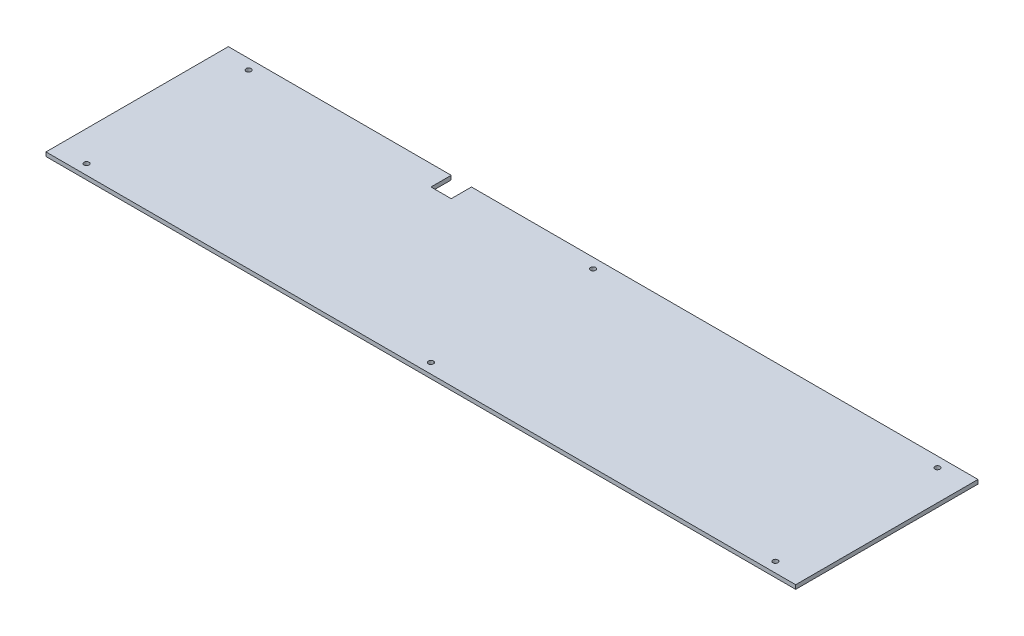
ISO-10303-21;
HEADER;
FILE_DESCRIPTION(('STEP AP214'),'2;1');
FILE_NAME('part.step','',(''),(''),'','','');
FILE_SCHEMA(('AUTOMOTIVE_DESIGN { 1 0 10303 214 1 1 1 1 }'));
ENDSEC;
DATA;
#1=APPLICATION_CONTEXT('core data for automotive mechanical design processes');
#2=APPLICATION_PROTOCOL_DEFINITION('international standard','automotive_design',2000,#1);
#3=PRODUCT_CONTEXT('',#1,'mechanical');
#4=PRODUCT('Part','Part','',(#3));
#5=PRODUCT_RELATED_PRODUCT_CATEGORY('part','',(#4));
#6=PRODUCT_DEFINITION_FORMATION('','',#4);
#7=PRODUCT_DEFINITION_CONTEXT('part definition',#1,'design');
#8=PRODUCT_DEFINITION('design','',#6,#7);
#9=PRODUCT_DEFINITION_SHAPE('','',#8);
#10=(LENGTH_UNIT() NAMED_UNIT(*) SI_UNIT(.MILLI.,.METRE.));
#11=(NAMED_UNIT(*) PLANE_ANGLE_UNIT() SI_UNIT($,.RADIAN.));
#12=(NAMED_UNIT(*) SI_UNIT($,.STERADIAN.) SOLID_ANGLE_UNIT());
#13=UNCERTAINTY_MEASURE_WITH_UNIT(LENGTH_MEASURE(1.E-05),#10,'distance_accuracy_value','');
#14=(GEOMETRIC_REPRESENTATION_CONTEXT(3) GLOBAL_UNCERTAINTY_ASSIGNED_CONTEXT((#13)) GLOBAL_UNIT_ASSIGNED_CONTEXT((#10,
#11,#12)) REPRESENTATION_CONTEXT('',''));
#15=CARTESIAN_POINT('',(0.,0.,0.));
#16=DIRECTION('',(0.,0.,1.));
#17=DIRECTION('',(1.,0.,0.));
#18=AXIS2_PLACEMENT_3D('',#15,#16,#17);
#19=CARTESIAN_POINT('',(0.,4.,0.));
#20=DIRECTION('',(0.,1.,0.));
#21=DIRECTION('',(0.,0.,1.));
#22=AXIS2_PLACEMENT_3D('',#19,#20,#21);
#23=PLANE('',#22);
#24=CARTESIAN_POINT('',(0.,4.,80.0000000000001));
#25=DIRECTION('',(0.,1.,0.));
#26=DIRECTION('',(0.,0.,-1.));
#27=AXIS2_PLACEMENT_3D('',#24,#25,#26);
#28=CIRCLE('',#27,2.5);
#29=CARTESIAN_POINT('',(0.,4.,77.5000000000001));
#30=VERTEX_POINT('',#29);
#31=EDGE_CURVE('E237',#30,#30,#28,.T.);
#32=ORIENTED_EDGE('',*,*,#31,.F.);
#33=EDGE_LOOP('',(#32));
#34=FACE_BOUND('',#33,.T.);
#35=CARTESIAN_POINT('',(0.,4.,-80.));
#36=DIRECTION('',(0.,1.,0.));
#37=DIRECTION('',(0.,0.,1.));
#38=AXIS2_PLACEMENT_3D('',#35,#36,#37);
#39=CIRCLE('',#38,2.5);
#40=CARTESIAN_POINT('',(0.,4.,-77.5));
#41=VERTEX_POINT('',#40);
#42=EDGE_CURVE('E221',#41,#41,#39,.T.);
#43=ORIENTED_EDGE('',*,*,#42,.F.);
#44=EDGE_LOOP('',(#43));
#45=FACE_BOUND('',#44,.T.);
#46=CARTESIAN_POINT('',(-340.,4.,-80.0000000000001));
#47=DIRECTION('',(0.,1.,0.));
#48=DIRECTION('',(0.,0.,1.));
#49=AXIS2_PLACEMENT_3D('',#46,#47,#48);
#50=CIRCLE('',#49,2.50000000000002);
#51=CARTESIAN_POINT('',(-340.,4.,-77.5000000000001));
#52=VERTEX_POINT('',#51);
#53=EDGE_CURVE('E146',#52,#52,#50,.T.);
#54=ORIENTED_EDGE('',*,*,#53,.F.);
#55=EDGE_LOOP('',(#54));
#56=FACE_BOUND('',#55,.T.);
#57=DIRECTION('',(-1.,0.,0.));
#58=VECTOR('',#57,1.);
#59=CARTESIAN_POINT('',(-130.,4.,-90.));
#60=LINE('',#59,#58);
#61=CARTESIAN_POINT('',(370.,4.,-90.0000000000002));
#62=VERTEX_POINT('',#61);
#63=CARTESIAN_POINT('',(-130.,4.,-90.));
#64=VERTEX_POINT('',#63);
#65=EDGE_CURVE('E164',#62,#64,#60,.T.);
#66=ORIENTED_EDGE('',*,*,#65,.T.);
#67=DIRECTION('',(0.,0.,1.));
#68=VECTOR('',#67,1.);
#69=CARTESIAN_POINT('',(-130.,4.,-90.));
#70=LINE('',#69,#68);
#71=CARTESIAN_POINT('',(-130.,4.,-70.));
#72=VERTEX_POINT('',#71);
#73=EDGE_CURVE('E100',#64,#72,#70,.T.);
#74=ORIENTED_EDGE('',*,*,#73,.T.);
#75=DIRECTION('',(-1.,0.,0.));
#76=VECTOR('',#75,1.);
#77=CARTESIAN_POINT('',(-130.,4.,-70.));
#78=LINE('',#77,#76);
#79=CARTESIAN_POINT('',(-150.,4.,-70.));
#80=VERTEX_POINT('',#79);
#81=EDGE_CURVE('E185',#72,#80,#78,.T.);
#82=ORIENTED_EDGE('',*,*,#81,.T.);
#83=DIRECTION('',(0.,0.,-1.));
#84=VECTOR('',#83,1.);
#85=CARTESIAN_POINT('',(-150.,4.,-90.));
#86=LINE('',#85,#84);
#87=CARTESIAN_POINT('',(-150.,4.,-90.));
#88=VERTEX_POINT('',#87);
#89=EDGE_CURVE('E199',#80,#88,#86,.T.);
#90=ORIENTED_EDGE('',*,*,#89,.T.);
#91=DIRECTION('',(-1.,0.,0.));
#92=VECTOR('',#91,1.);
#93=CARTESIAN_POINT('',(-370.,4.,-90.0000000000001));
#94=LINE('',#93,#92);
#95=CARTESIAN_POINT('',(-370.,4.,-90.0000000000001));
#96=VERTEX_POINT('',#95);
#97=EDGE_CURVE('E119',#88,#96,#94,.T.);
#98=ORIENTED_EDGE('',*,*,#97,.T.);
#99=DIRECTION('',(0.,0.,1.));
#100=VECTOR('',#99,1.);
#101=CARTESIAN_POINT('',(-370.,4.,89.9999999999999));
#102=LINE('',#101,#100);
#103=CARTESIAN_POINT('',(-370.,4.,89.9999999999999));
#104=VERTEX_POINT('',#103);
#105=EDGE_CURVE('E113',#96,#104,#102,.T.);
#106=ORIENTED_EDGE('',*,*,#105,.T.);
#107=DIRECTION('',(1.,0.,0.));
#108=VECTOR('',#107,1.);
#109=CARTESIAN_POINT('',(-370.,4.,89.9999999999999));
#110=LINE('',#109,#108);
#111=CARTESIAN_POINT('',(370.,4.,89.9999999999998));
#112=VERTEX_POINT('',#111);
#113=EDGE_CURVE('E117',#104,#112,#110,.T.);
#114=ORIENTED_EDGE('',*,*,#113,.T.);
#115=DIRECTION('',(0.,0.,-1.));
#116=VECTOR('',#115,1.);
#117=CARTESIAN_POINT('',(370.,4.,89.9999999999998));
#118=LINE('',#117,#116);
#119=EDGE_CURVE('E57',#112,#62,#118,.T.);
#120=ORIENTED_EDGE('',*,*,#119,.T.);
#121=EDGE_LOOP('',(#66,#74,#82,#90,#98,#106,#114,#120));
#122=FACE_BOUND('',#121,.T.);
#123=CARTESIAN_POINT('',(340.,4.,-80.0000000000002));
#124=DIRECTION('',(0.,1.,0.));
#125=DIRECTION('',(0.,0.,-1.));
#126=AXIS2_PLACEMENT_3D('',#123,#124,#125);
#127=CIRCLE('',#126,2.50000000000002);
#128=CARTESIAN_POINT('',(340.,4.,-82.5000000000002));
#129=VERTEX_POINT('',#128);
#130=EDGE_CURVE('E213',#129,#129,#127,.T.);
#131=ORIENTED_EDGE('',*,*,#130,.F.);
#132=EDGE_LOOP('',(#131));
#133=FACE_BOUND('',#132,.T.);
#134=CARTESIAN_POINT('',(-340.,4.,80.0000000000001));
#135=DIRECTION('',(0.,1.,0.));
#136=DIRECTION('',(0.,0.,-1.));
#137=AXIS2_PLACEMENT_3D('',#134,#135,#136);
#138=CIRCLE('',#137,2.50000000000002);
#139=CARTESIAN_POINT('',(-340.,4.,77.5000000000001));
#140=VERTEX_POINT('',#139);
#141=EDGE_CURVE('E229',#140,#140,#138,.T.);
#142=ORIENTED_EDGE('',*,*,#141,.F.);
#143=EDGE_LOOP('',(#142));
#144=FACE_BOUND('',#143,.T.);
#145=CARTESIAN_POINT('',(340.,4.,80.0000000000002));
#146=DIRECTION('',(0.,1.,0.));
#147=DIRECTION('',(0.,0.,1.));
#148=AXIS2_PLACEMENT_3D('',#145,#146,#147);
#149=CIRCLE('',#148,2.50000000000002);
#150=CARTESIAN_POINT('',(340.,4.,82.5000000000002));
#151=VERTEX_POINT('',#150);
#152=EDGE_CURVE('E245',#151,#151,#149,.T.);
#153=ORIENTED_EDGE('',*,*,#152,.F.);
#154=EDGE_LOOP('',(#153));
#155=FACE_BOUND('',#154,.T.);
#156=ADVANCED_FACE('F39',(#34,#45,#56,#122,#133,#144,#155),#23,.T.);
#157=CARTESIAN_POINT('',(0.,0.,0.));
#158=DIRECTION('',(0.,1.,0.));
#159=DIRECTION('',(0.,0.,1.));
#160=AXIS2_PLACEMENT_3D('',#157,#158,#159);
#161=PLANE('',#160);
#162=DIRECTION('',(-1.,0.,0.));
#163=VECTOR('',#162,1.);
#164=CARTESIAN_POINT('',(-130.,0.,-90.));
#165=LINE('',#164,#163);
#166=CARTESIAN_POINT('',(370.,0.,-90.0000000000002));
#167=VERTEX_POINT('',#166);
#168=CARTESIAN_POINT('',(-130.,0.,-90.));
#169=VERTEX_POINT('',#168);
#170=EDGE_CURVE('E141',#167,#169,#165,.T.);
#171=ORIENTED_EDGE('',*,*,#170,.F.);
#172=DIRECTION('',(0.,0.,-1.));
#173=VECTOR('',#172,1.);
#174=CARTESIAN_POINT('',(370.,0.,89.9999999999998));
#175=LINE('',#174,#173);
#176=CARTESIAN_POINT('',(370.,0.,89.9999999999998));
#177=VERTEX_POINT('',#176);
#178=EDGE_CURVE('E92',#177,#167,#175,.T.);
#179=ORIENTED_EDGE('',*,*,#178,.F.);
#180=DIRECTION('',(1.,0.,0.));
#181=VECTOR('',#180,1.);
#182=CARTESIAN_POINT('',(-370.,0.,89.9999999999999));
#183=LINE('',#182,#181);
#184=CARTESIAN_POINT('',(-370.,0.,89.9999999999999));
#185=VERTEX_POINT('',#184);
#186=EDGE_CURVE('E86',#185,#177,#183,.T.);
#187=ORIENTED_EDGE('',*,*,#186,.F.);
#188=DIRECTION('',(0.,0.,1.));
#189=VECTOR('',#188,1.);
#190=CARTESIAN_POINT('',(-370.,0.,89.9999999999999));
#191=LINE('',#190,#189);
#192=CARTESIAN_POINT('',(-370.,0.,-90.0000000000001));
#193=VERTEX_POINT('',#192);
#194=EDGE_CURVE('E128',#193,#185,#191,.T.);
#195=ORIENTED_EDGE('',*,*,#194,.F.);
#196=DIRECTION('',(-1.,0.,0.));
#197=VECTOR('',#196,1.);
#198=CARTESIAN_POINT('',(-370.,0.,-90.0000000000001));
#199=LINE('',#198,#197);
#200=CARTESIAN_POINT('',(-150.,0.,-90.));
#201=VERTEX_POINT('',#200);
#202=EDGE_CURVE('E155',#201,#193,#199,.T.);
#203=ORIENTED_EDGE('',*,*,#202,.F.);
#204=DIRECTION('',(0.,0.,-1.));
#205=VECTOR('',#204,1.);
#206=CARTESIAN_POINT('',(-150.,0.,-90.));
#207=LINE('',#206,#205);
#208=CARTESIAN_POINT('',(-150.,0.,-70.));
#209=VERTEX_POINT('',#208);
#210=EDGE_CURVE('E152',#209,#201,#207,.T.);
#211=ORIENTED_EDGE('',*,*,#210,.F.);
#212=DIRECTION('',(-1.,0.,0.));
#213=VECTOR('',#212,1.);
#214=CARTESIAN_POINT('',(-130.,0.,-70.));
#215=LINE('',#214,#213);
#216=CARTESIAN_POINT('',(-130.,0.,-70.));
#217=VERTEX_POINT('',#216);
#218=EDGE_CURVE('E149',#217,#209,#215,.T.);
#219=ORIENTED_EDGE('',*,*,#218,.F.);
#220=DIRECTION('',(0.,0.,1.));
#221=VECTOR('',#220,1.);
#222=CARTESIAN_POINT('',(-130.,0.,-90.));
#223=LINE('',#222,#221);
#224=EDGE_CURVE('E145',#169,#217,#223,.T.);
#225=ORIENTED_EDGE('',*,*,#224,.F.);
#226=EDGE_LOOP('',(#171,#179,#187,#195,#203,#211,#219,#225));
#227=FACE_BOUND('',#226,.T.);
#228=CARTESIAN_POINT('',(-340.,0.,-80.0000000000001));
#229=DIRECTION('',(0.,1.,0.));
#230=DIRECTION('',(0.,0.,1.));
#231=AXIS2_PLACEMENT_3D('',#228,#229,#230);
#232=CIRCLE('',#231,2.50000000000002);
#233=CARTESIAN_POINT('',(-340.,0.,-77.5000000000001));
#234=VERTEX_POINT('',#233);
#235=EDGE_CURVE('E209',#234,#234,#232,.T.);
#236=ORIENTED_EDGE('',*,*,#235,.T.);
#237=EDGE_LOOP('',(#236));
#238=FACE_BOUND('',#237,.T.);
#239=CARTESIAN_POINT('',(340.,0.,-80.0000000000002));
#240=DIRECTION('',(0.,1.,0.));
#241=DIRECTION('',(0.,0.,-1.));
#242=AXIS2_PLACEMENT_3D('',#239,#240,#241);
#243=CIRCLE('',#242,2.50000000000002);
#244=CARTESIAN_POINT('',(340.,0.,-82.5000000000002));
#245=VERTEX_POINT('',#244);
#246=EDGE_CURVE('E217',#245,#245,#243,.T.);
#247=ORIENTED_EDGE('',*,*,#246,.T.);
#248=EDGE_LOOP('',(#247));
#249=FACE_BOUND('',#248,.T.);
#250=CARTESIAN_POINT('',(0.,0.,-80.));
#251=DIRECTION('',(0.,1.,0.));
#252=DIRECTION('',(0.,0.,1.));
#253=AXIS2_PLACEMENT_3D('',#250,#251,#252);
#254=CIRCLE('',#253,2.5);
#255=CARTESIAN_POINT('',(0.,0.,-77.5));
#256=VERTEX_POINT('',#255);
#257=EDGE_CURVE('E225',#256,#256,#254,.T.);
#258=ORIENTED_EDGE('',*,*,#257,.T.);
#259=EDGE_LOOP('',(#258));
#260=FACE_BOUND('',#259,.T.);
#261=CARTESIAN_POINT('',(-340.,0.,80.0000000000001));
#262=DIRECTION('',(0.,1.,0.));
#263=DIRECTION('',(0.,0.,-1.));
#264=AXIS2_PLACEMENT_3D('',#261,#262,#263);
#265=CIRCLE('',#264,2.50000000000002);
#266=CARTESIAN_POINT('',(-340.,0.,77.5000000000001));
#267=VERTEX_POINT('',#266);
#268=EDGE_CURVE('E233',#267,#267,#265,.T.);
#269=ORIENTED_EDGE('',*,*,#268,.T.);
#270=EDGE_LOOP('',(#269));
#271=FACE_BOUND('',#270,.T.);
#272=CARTESIAN_POINT('',(0.,0.,80.0000000000001));
#273=DIRECTION('',(0.,1.,0.));
#274=DIRECTION('',(0.,0.,-1.));
#275=AXIS2_PLACEMENT_3D('',#272,#273,#274);
#276=CIRCLE('',#275,2.5);
#277=CARTESIAN_POINT('',(0.,0.,77.5000000000001));
#278=VERTEX_POINT('',#277);
#279=EDGE_CURVE('E241',#278,#278,#276,.T.);
#280=ORIENTED_EDGE('',*,*,#279,.T.);
#281=EDGE_LOOP('',(#280));
#282=FACE_BOUND('',#281,.T.);
#283=CARTESIAN_POINT('',(340.,0.,80.0000000000002));
#284=DIRECTION('',(0.,1.,0.));
#285=DIRECTION('',(0.,0.,1.));
#286=AXIS2_PLACEMENT_3D('',#283,#284,#285);
#287=CIRCLE('',#286,2.50000000000002);
#288=CARTESIAN_POINT('',(340.,0.,82.5000000000002));
#289=VERTEX_POINT('',#288);
#290=EDGE_CURVE('E249',#289,#289,#287,.T.);
#291=ORIENTED_EDGE('',*,*,#290,.T.);
#292=EDGE_LOOP('',(#291));
#293=FACE_BOUND('',#292,.T.);
#294=ADVANCED_FACE('F189',(#227,#238,#249,#260,#271,#282,#293),#161,.F.);
#295=CARTESIAN_POINT('',(-130.,4.,-90.));
#296=DIRECTION('',(0.,0.,1.));
#297=DIRECTION('',(1.,0.,0.));
#298=AXIS2_PLACEMENT_3D('',#295,#296,#297);
#299=PLANE('',#298);
#300=ORIENTED_EDGE('',*,*,#170,.T.);
#301=DIRECTION('',(0.,-1.,0.));
#302=VECTOR('',#301,1.);
#303=CARTESIAN_POINT('',(-130.,4.,-90.));
#304=LINE('',#303,#302);
#305=EDGE_CURVE('E11',#64,#169,#304,.T.);
#306=ORIENTED_EDGE('',*,*,#305,.F.);
#307=ORIENTED_EDGE('',*,*,#65,.F.);
#308=DIRECTION('',(0.,-1.,0.));
#309=VECTOR('',#308,1.);
#310=CARTESIAN_POINT('',(370.,4.,-90.0000000000002));
#311=LINE('',#310,#309);
#312=EDGE_CURVE('E137',#62,#167,#311,.T.);
#313=ORIENTED_EDGE('',*,*,#312,.T.);
#314=EDGE_LOOP('',(#300,#306,#307,#313));
#315=FACE_BOUND('',#314,.T.);
#316=ADVANCED_FACE('F41',(#315),#299,.F.);
#317=CARTESIAN_POINT('',(-130.,4.,-90.));
#318=DIRECTION('',(1.,0.,0.));
#319=DIRECTION('',(0.,0.,-1.));
#320=AXIS2_PLACEMENT_3D('',#317,#318,#319);
#321=PLANE('',#320);
#322=ORIENTED_EDGE('',*,*,#224,.T.);
#323=DIRECTION('',(0.,-1.,0.));
#324=VECTOR('',#323,1.);
#325=CARTESIAN_POINT('',(-130.,4.,-70.));
#326=LINE('',#325,#324);
#327=EDGE_CURVE('E49',#72,#217,#326,.T.);
#328=ORIENTED_EDGE('',*,*,#327,.F.);
#329=ORIENTED_EDGE('',*,*,#73,.F.);
#330=ORIENTED_EDGE('',*,*,#305,.T.);
#331=EDGE_LOOP('',(#322,#328,#329,#330));
#332=FACE_BOUND('',#331,.T.);
#333=ADVANCED_FACE('F285',(#332),#321,.F.);
#334=CARTESIAN_POINT('',(-130.,4.,-70.));
#335=DIRECTION('',(0.,0.,1.));
#336=DIRECTION('',(1.,0.,0.));
#337=AXIS2_PLACEMENT_3D('',#334,#335,#336);
#338=PLANE('',#337);
#339=ORIENTED_EDGE('',*,*,#218,.T.);
#340=DIRECTION('',(0.,-1.,0.));
#341=VECTOR('',#340,1.);
#342=CARTESIAN_POINT('',(-150.,4.,-70.));
#343=LINE('',#342,#341);
#344=EDGE_CURVE('E175',#80,#209,#343,.T.);
#345=ORIENTED_EDGE('',*,*,#344,.F.);
#346=ORIENTED_EDGE('',*,*,#81,.F.);
#347=ORIENTED_EDGE('',*,*,#327,.T.);
#348=EDGE_LOOP('',(#339,#345,#346,#347));
#349=FACE_BOUND('',#348,.T.);
#350=ADVANCED_FACE('F183',(#349),#338,.F.);
#351=CARTESIAN_POINT('',(-150.,4.,-90.));
#352=DIRECTION('',(-1.,0.,0.));
#353=DIRECTION('',(0.,0.,1.));
#354=AXIS2_PLACEMENT_3D('',#351,#352,#353);
#355=PLANE('',#354);
#356=ORIENTED_EDGE('',*,*,#210,.T.);
#357=DIRECTION('',(0.,-1.,0.));
#358=VECTOR('',#357,1.);
#359=CARTESIAN_POINT('',(-150.,4.,-90.));
#360=LINE('',#359,#358);
#361=EDGE_CURVE('E171',#88,#201,#360,.T.);
#362=ORIENTED_EDGE('',*,*,#361,.F.);
#363=ORIENTED_EDGE('',*,*,#89,.F.);
#364=ORIENTED_EDGE('',*,*,#344,.T.);
#365=EDGE_LOOP('',(#356,#362,#363,#364));
#366=FACE_BOUND('',#365,.T.);
#367=ADVANCED_FACE('F194',(#366),#355,.F.);
#368=CARTESIAN_POINT('',(-370.,4.,-90.0000000000001));
#369=DIRECTION('',(0.,0.,1.));
#370=DIRECTION('',(1.,0.,0.));
#371=AXIS2_PLACEMENT_3D('',#368,#369,#370);
#372=PLANE('',#371);
#373=ORIENTED_EDGE('',*,*,#202,.T.);
#374=DIRECTION('',(0.,-1.,0.));
#375=VECTOR('',#374,1.);
#376=CARTESIAN_POINT('',(-370.,4.,-90.0000000000001));
#377=LINE('',#376,#375);
#378=EDGE_CURVE('E130',#96,#193,#377,.T.);
#379=ORIENTED_EDGE('',*,*,#378,.F.);
#380=ORIENTED_EDGE('',*,*,#97,.F.);
#381=ORIENTED_EDGE('',*,*,#361,.T.);
#382=EDGE_LOOP('',(#373,#379,#380,#381));
#383=FACE_BOUND('',#382,.T.);
#384=ADVANCED_FACE('F197',(#383),#372,.F.);
#385=CARTESIAN_POINT('',(-370.,4.,89.9999999999999));
#386=DIRECTION('',(1.,0.,0.));
#387=DIRECTION('',(0.,0.,-1.));
#388=AXIS2_PLACEMENT_3D('',#385,#386,#387);
#389=PLANE('',#388);
#390=ORIENTED_EDGE('',*,*,#194,.T.);
#391=DIRECTION('',(0.,-1.,0.));
#392=VECTOR('',#391,1.);
#393=CARTESIAN_POINT('',(-370.,4.,89.9999999999999));
#394=LINE('',#393,#392);
#395=EDGE_CURVE('E125',#104,#185,#394,.T.);
#396=ORIENTED_EDGE('',*,*,#395,.F.);
#397=ORIENTED_EDGE('',*,*,#105,.F.);
#398=ORIENTED_EDGE('',*,*,#378,.T.);
#399=EDGE_LOOP('',(#390,#396,#397,#398));
#400=FACE_BOUND('',#399,.T.);
#401=ADVANCED_FACE('F126',(#400),#389,.F.);
#402=CARTESIAN_POINT('',(-370.,4.,89.9999999999999));
#403=DIRECTION('',(0.,0.,-1.));
#404=DIRECTION('',(-1.,0.,0.));
#405=AXIS2_PLACEMENT_3D('',#402,#403,#404);
#406=PLANE('',#405);
#407=ORIENTED_EDGE('',*,*,#186,.T.);
#408=DIRECTION('',(0.,-1.,0.));
#409=VECTOR('',#408,1.);
#410=CARTESIAN_POINT('',(370.,4.,89.9999999999998));
#411=LINE('',#410,#409);
#412=EDGE_CURVE('E131',#112,#177,#411,.T.);
#413=ORIENTED_EDGE('',*,*,#412,.F.);
#414=ORIENTED_EDGE('',*,*,#113,.F.);
#415=ORIENTED_EDGE('',*,*,#395,.T.);
#416=EDGE_LOOP('',(#407,#413,#414,#415));
#417=FACE_BOUND('',#416,.T.);
#418=ADVANCED_FACE('F133',(#417),#406,.F.);
#419=CARTESIAN_POINT('',(370.,4.,89.9999999999998));
#420=DIRECTION('',(-1.,0.,0.));
#421=DIRECTION('',(0.,0.,1.));
#422=AXIS2_PLACEMENT_3D('',#419,#420,#421);
#423=PLANE('',#422);
#424=ORIENTED_EDGE('',*,*,#178,.T.);
#425=ORIENTED_EDGE('',*,*,#312,.F.);
#426=ORIENTED_EDGE('',*,*,#119,.F.);
#427=ORIENTED_EDGE('',*,*,#412,.T.);
#428=EDGE_LOOP('',(#424,#425,#426,#427));
#429=FACE_BOUND('',#428,.T.);
#430=ADVANCED_FACE('F273',(#429),#423,.F.);
#431=CARTESIAN_POINT('',(-340.,4.,-80.0000000000001));
#432=DIRECTION('',(0.,-1.,0.));
#433=DIRECTION('',(0.,0.,-1.));
#434=AXIS2_PLACEMENT_3D('',#431,#432,#433);
#435=CYLINDRICAL_SURFACE('',#434,2.50000000000002);
#436=ORIENTED_EDGE('',*,*,#53,.T.);
#437=EDGE_LOOP('',(#436));
#438=FACE_BOUND('',#437,.T.);
#439=ORIENTED_EDGE('',*,*,#235,.F.);
#440=EDGE_LOOP('',(#439));
#441=FACE_BOUND('',#440,.T.);
#442=ADVANCED_FACE('F270',(#438,#441),#435,.F.);
#443=CARTESIAN_POINT('',(340.,4.,-80.0000000000002));
#444=DIRECTION('',(0.,-1.,0.));
#445=DIRECTION('',(0.,0.,-1.));
#446=AXIS2_PLACEMENT_3D('',#443,#444,#445);
#447=CYLINDRICAL_SURFACE('',#446,2.50000000000002);
#448=ORIENTED_EDGE('',*,*,#130,.T.);
#449=EDGE_LOOP('',(#448));
#450=FACE_BOUND('',#449,.T.);
#451=ORIENTED_EDGE('',*,*,#246,.F.);
#452=EDGE_LOOP('',(#451));
#453=FACE_BOUND('',#452,.T.);
#454=ADVANCED_FACE('F349',(#450,#453),#447,.F.);
#455=CARTESIAN_POINT('',(0.,4.,-80.));
#456=DIRECTION('',(0.,-1.,0.));
#457=DIRECTION('',(0.,0.,-1.));
#458=AXIS2_PLACEMENT_3D('',#455,#456,#457);
#459=CYLINDRICAL_SURFACE('',#458,2.5);
#460=ORIENTED_EDGE('',*,*,#42,.T.);
#461=EDGE_LOOP('',(#460));
#462=FACE_BOUND('',#461,.T.);
#463=ORIENTED_EDGE('',*,*,#257,.F.);
#464=EDGE_LOOP('',(#463));
#465=FACE_BOUND('',#464,.T.);
#466=ADVANCED_FACE('F357',(#462,#465),#459,.F.);
#467=CARTESIAN_POINT('',(-340.,4.,80.0000000000001));
#468=DIRECTION('',(0.,-1.,0.));
#469=DIRECTION('',(0.,0.,-1.));
#470=AXIS2_PLACEMENT_3D('',#467,#468,#469);
#471=CYLINDRICAL_SURFACE('',#470,2.50000000000002);
#472=ORIENTED_EDGE('',*,*,#141,.T.);
#473=EDGE_LOOP('',(#472));
#474=FACE_BOUND('',#473,.T.);
#475=ORIENTED_EDGE('',*,*,#268,.F.);
#476=EDGE_LOOP('',(#475));
#477=FACE_BOUND('',#476,.T.);
#478=ADVANCED_FACE('F365',(#474,#477),#471,.F.);
#479=CARTESIAN_POINT('',(0.,4.,80.0000000000001));
#480=DIRECTION('',(0.,-1.,0.));
#481=DIRECTION('',(0.,0.,-1.));
#482=AXIS2_PLACEMENT_3D('',#479,#480,#481);
#483=CYLINDRICAL_SURFACE('',#482,2.5);
#484=ORIENTED_EDGE('',*,*,#31,.T.);
#485=EDGE_LOOP('',(#484));
#486=FACE_BOUND('',#485,.T.);
#487=ORIENTED_EDGE('',*,*,#279,.F.);
#488=EDGE_LOOP('',(#487));
#489=FACE_BOUND('',#488,.T.);
#490=ADVANCED_FACE('F374',(#486,#489),#483,.F.);
#491=CARTESIAN_POINT('',(340.,4.,80.0000000000002));
#492=DIRECTION('',(0.,-1.,0.));
#493=DIRECTION('',(0.,0.,-1.));
#494=AXIS2_PLACEMENT_3D('',#491,#492,#493);
#495=CYLINDRICAL_SURFACE('',#494,2.50000000000002);
#496=ORIENTED_EDGE('',*,*,#152,.T.);
#497=EDGE_LOOP('',(#496));
#498=FACE_BOUND('',#497,.T.);
#499=ORIENTED_EDGE('',*,*,#290,.F.);
#500=EDGE_LOOP('',(#499));
#501=FACE_BOUND('',#500,.T.);
#502=ADVANCED_FACE('F257',(#498,#501),#495,.F.);
#503=CLOSED_SHELL('',(#156,#294,#316,#333,#350,#367,#384,#401,#418,#430,#442,#454,#466,#478,
#490,#502));
#504=MANIFOLD_SOLID_BREP('B2',#503);
#505=ADVANCED_BREP_SHAPE_REPRESENTATION('',(#18,#504),#14);
#506=SHAPE_DEFINITION_REPRESENTATION(#9,#505);
ENDSEC;
END-ISO-10303-21;
